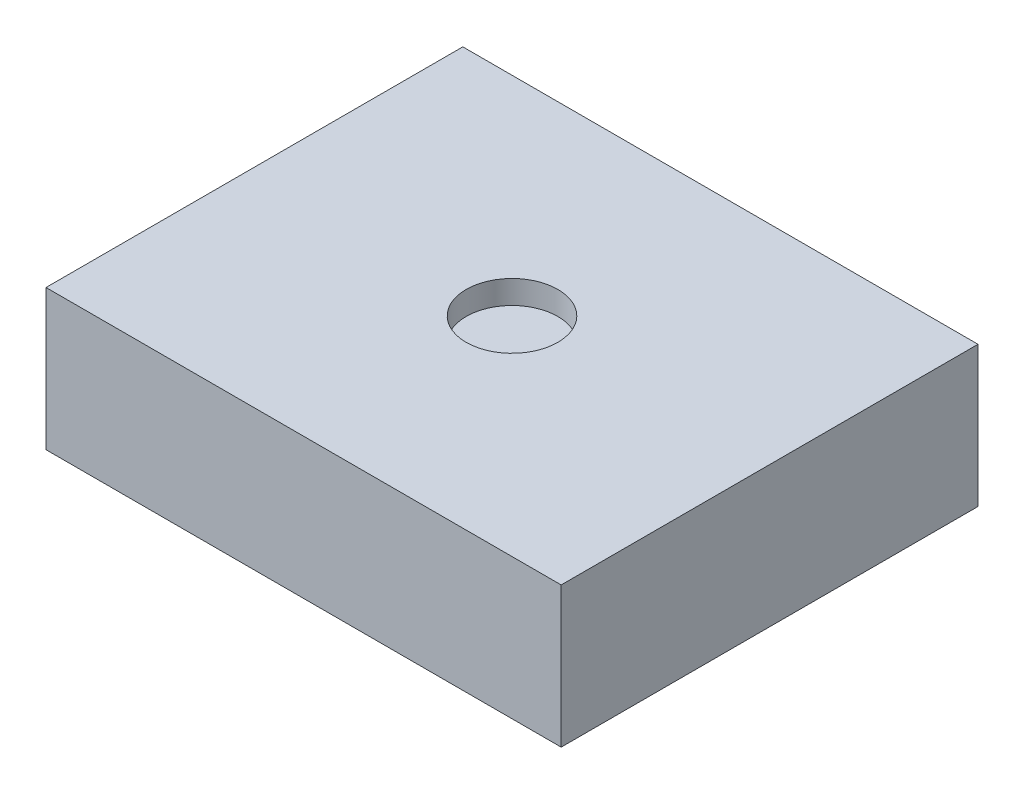
ISO-10303-21;
HEADER;
FILE_DESCRIPTION(('STEP AP214'),'2;1');
FILE_NAME('part.step','',(''),(''),'','','');
FILE_SCHEMA(('AUTOMOTIVE_DESIGN { 1 0 10303 214 1 1 1 1 }'));
ENDSEC;
DATA;
#1=APPLICATION_CONTEXT('core data for automotive mechanical design processes');
#2=APPLICATION_PROTOCOL_DEFINITION('international standard','automotive_design',2000,#1);
#3=PRODUCT_CONTEXT('',#1,'mechanical');
#4=PRODUCT('Part','Part','',(#3));
#5=PRODUCT_RELATED_PRODUCT_CATEGORY('part','',(#4));
#6=PRODUCT_DEFINITION_FORMATION('','',#4);
#7=PRODUCT_DEFINITION_CONTEXT('part definition',#1,'design');
#8=PRODUCT_DEFINITION('design','',#6,#7);
#9=PRODUCT_DEFINITION_SHAPE('','',#8);
#10=(LENGTH_UNIT() NAMED_UNIT(*) SI_UNIT(.MILLI.,.METRE.));
#11=(NAMED_UNIT(*) PLANE_ANGLE_UNIT() SI_UNIT($,.RADIAN.));
#12=(NAMED_UNIT(*) SI_UNIT($,.STERADIAN.) SOLID_ANGLE_UNIT());
#13=UNCERTAINTY_MEASURE_WITH_UNIT(LENGTH_MEASURE(1.E-05),#10,'distance_accuracy_value','');
#14=(GEOMETRIC_REPRESENTATION_CONTEXT(3) GLOBAL_UNCERTAINTY_ASSIGNED_CONTEXT((#13)) GLOBAL_UNIT_ASSIGNED_CONTEXT((#10,
#11,#12)) REPRESENTATION_CONTEXT('',''));
#15=CARTESIAN_POINT('',(0.,0.,0.));
#16=DIRECTION('',(0.,0.,1.));
#17=DIRECTION('',(1.,0.,0.));
#18=AXIS2_PLACEMENT_3D('',#15,#16,#17);
#19=CARTESIAN_POINT('',(13.97,7.62,11.303));
#20=DIRECTION('',(-1.,0.,0.));
#21=DIRECTION('',(0.,0.,1.));
#22=AXIS2_PLACEMENT_3D('',#19,#20,#21);
#23=PLANE('',#22);
#24=DIRECTION('',(0.,0.,-1.));
#25=VECTOR('',#24,1.);
#26=CARTESIAN_POINT('',(13.97,0.,11.303));
#27=LINE('',#26,#25);
#28=CARTESIAN_POINT('',(13.97,0.,11.303));
#29=VERTEX_POINT('',#28);
#30=CARTESIAN_POINT('',(13.97,0.,-11.303));
#31=VERTEX_POINT('',#30);
#32=EDGE_CURVE('E96',#29,#31,#27,.T.);
#33=ORIENTED_EDGE('',*,*,#32,.T.);
#34=DIRECTION('',(0.,-1.,0.));
#35=VECTOR('',#34,1.);
#36=CARTESIAN_POINT('',(13.97,7.62,-11.303));
#37=LINE('',#36,#35);
#38=CARTESIAN_POINT('',(13.97,7.62,-11.303));
#39=VERTEX_POINT('',#38);
#40=EDGE_CURVE('E11',#39,#31,#37,.T.);
#41=ORIENTED_EDGE('',*,*,#40,.F.);
#42=DIRECTION('',(0.,0.,-1.));
#43=VECTOR('',#42,1.);
#44=CARTESIAN_POINT('',(13.97,7.62,11.303));
#45=LINE('',#44,#43);
#46=CARTESIAN_POINT('',(13.97,7.62,11.303));
#47=VERTEX_POINT('',#46);
#48=EDGE_CURVE('E84',#47,#39,#45,.T.);
#49=ORIENTED_EDGE('',*,*,#48,.F.);
#50=DIRECTION('',(0.,-1.,0.));
#51=VECTOR('',#50,1.);
#52=CARTESIAN_POINT('',(13.97,7.62,11.303));
#53=LINE('',#52,#51);
#54=EDGE_CURVE('E92',#47,#29,#53,.T.);
#55=ORIENTED_EDGE('',*,*,#54,.T.);
#56=EDGE_LOOP('',(#33,#41,#49,#55));
#57=FACE_BOUND('',#56,.T.);
#58=ADVANCED_FACE('F33',(#57),#23,.F.);
#59=CARTESIAN_POINT('',(-13.97,7.62,-11.303));
#60=DIRECTION('',(0.,0.,1.));
#61=DIRECTION('',(1.,0.,0.));
#62=AXIS2_PLACEMENT_3D('',#59,#60,#61);
#63=PLANE('',#62);
#64=DIRECTION('',(-1.,0.,0.));
#65=VECTOR('',#64,1.);
#66=CARTESIAN_POINT('',(-13.97,0.,-11.303));
#67=LINE('',#66,#65);
#68=CARTESIAN_POINT('',(-13.97,0.,-11.303));
#69=VERTEX_POINT('',#68);
#70=EDGE_CURVE('E88',#31,#69,#67,.T.);
#71=ORIENTED_EDGE('',*,*,#70,.T.);
#72=DIRECTION('',(0.,-1.,0.));
#73=VECTOR('',#72,1.);
#74=CARTESIAN_POINT('',(-13.97,7.62,-11.303));
#75=LINE('',#74,#73);
#76=CARTESIAN_POINT('',(-13.97,7.62,-11.303));
#77=VERTEX_POINT('',#76);
#78=EDGE_CURVE('E41',#77,#69,#75,.T.);
#79=ORIENTED_EDGE('',*,*,#78,.F.);
#80=DIRECTION('',(-1.,0.,0.));
#81=VECTOR('',#80,1.);
#82=CARTESIAN_POINT('',(-13.97,7.62,-11.303));
#83=LINE('',#82,#81);
#84=EDGE_CURVE('E79',#39,#77,#83,.T.);
#85=ORIENTED_EDGE('',*,*,#84,.F.);
#86=ORIENTED_EDGE('',*,*,#40,.T.);
#87=EDGE_LOOP('',(#71,#79,#85,#86));
#88=FACE_BOUND('',#87,.T.);
#89=ADVANCED_FACE('F87',(#88),#63,.F.);
#90=CARTESIAN_POINT('',(-13.97,7.62,11.303));
#91=DIRECTION('',(1.,0.,0.));
#92=DIRECTION('',(0.,0.,-1.));
#93=AXIS2_PLACEMENT_3D('',#90,#91,#92);
#94=PLANE('',#93);
#95=DIRECTION('',(0.,0.,1.));
#96=VECTOR('',#95,1.);
#97=CARTESIAN_POINT('',(-13.97,0.,11.303));
#98=LINE('',#97,#96);
#99=CARTESIAN_POINT('',(-13.97,0.,11.303));
#100=VERTEX_POINT('',#99);
#101=EDGE_CURVE('E66',#69,#100,#98,.T.);
#102=ORIENTED_EDGE('',*,*,#101,.T.);
#103=DIRECTION('',(0.,-1.,0.));
#104=VECTOR('',#103,1.);
#105=CARTESIAN_POINT('',(-13.97,7.62,11.303));
#106=LINE('',#105,#104);
#107=CARTESIAN_POINT('',(-13.97,7.62,11.303));
#108=VERTEX_POINT('',#107);
#109=EDGE_CURVE('E89',#108,#100,#106,.T.);
#110=ORIENTED_EDGE('',*,*,#109,.F.);
#111=DIRECTION('',(0.,0.,1.));
#112=VECTOR('',#111,1.);
#113=CARTESIAN_POINT('',(-13.97,7.62,11.303));
#114=LINE('',#113,#112);
#115=EDGE_CURVE('E82',#77,#108,#114,.T.);
#116=ORIENTED_EDGE('',*,*,#115,.F.);
#117=ORIENTED_EDGE('',*,*,#78,.T.);
#118=EDGE_LOOP('',(#102,#110,#116,#117));
#119=FACE_BOUND('',#118,.T.);
#120=ADVANCED_FACE('F90',(#119),#94,.F.);
#121=CARTESIAN_POINT('',(-13.97,7.62,11.303));
#122=DIRECTION('',(0.,0.,-1.));
#123=DIRECTION('',(-1.,0.,0.));
#124=AXIS2_PLACEMENT_3D('',#121,#122,#123);
#125=PLANE('',#124);
#126=DIRECTION('',(1.,0.,0.));
#127=VECTOR('',#126,1.);
#128=CARTESIAN_POINT('',(-13.97,0.,11.303));
#129=LINE('',#128,#127);
#130=EDGE_CURVE('E72',#100,#29,#129,.T.);
#131=ORIENTED_EDGE('',*,*,#130,.T.);
#132=ORIENTED_EDGE('',*,*,#54,.F.);
#133=DIRECTION('',(1.,0.,0.));
#134=VECTOR('',#133,1.);
#135=CARTESIAN_POINT('',(-13.97,7.62,11.303));
#136=LINE('',#135,#134);
#137=EDGE_CURVE('E49',#108,#47,#136,.T.);
#138=ORIENTED_EDGE('',*,*,#137,.F.);
#139=ORIENTED_EDGE('',*,*,#109,.T.);
#140=EDGE_LOOP('',(#131,#132,#138,#139));
#141=FACE_BOUND('',#140,.T.);
#142=ADVANCED_FACE('F104',(#141),#125,.F.);
#143=CARTESIAN_POINT('',(0.,7.62,0.));
#144=DIRECTION('',(0.,-1.,0.));
#145=DIRECTION('',(0.,0.,-1.));
#146=AXIS2_PLACEMENT_3D('',#143,#144,#145);
#147=PLANE('',#146);
#148=CARTESIAN_POINT('',(0.,7.62,0.));
#149=DIRECTION('',(0.,1.,0.));
#150=DIRECTION('',(0.,0.,1.));
#151=AXIS2_PLACEMENT_3D('',#148,#149,#150);
#152=CIRCLE('',#151,2.48630029454097);
#153=CARTESIAN_POINT('',(0.,7.62,2.48630029454097));
#154=VERTEX_POINT('',#153);
#155=EDGE_CURVE('E110',#154,#154,#152,.T.);
#156=ORIENTED_EDGE('',*,*,#155,.F.);
#157=EDGE_LOOP('',(#156));
#158=FACE_BOUND('',#157,.T.);
#159=ORIENTED_EDGE('',*,*,#48,.T.);
#160=ORIENTED_EDGE('',*,*,#84,.T.);
#161=ORIENTED_EDGE('',*,*,#115,.T.);
#162=ORIENTED_EDGE('',*,*,#137,.T.);
#163=EDGE_LOOP('',(#159,#160,#161,#162));
#164=FACE_BOUND('',#163,.T.);
#165=ADVANCED_FACE('F80',(#158,#164),#147,.F.);
#166=CARTESIAN_POINT('',(0.,0.,0.));
#167=DIRECTION('',(0.,-1.,0.));
#168=DIRECTION('',(0.,0.,-1.));
#169=AXIS2_PLACEMENT_3D('',#166,#167,#168);
#170=PLANE('',#169);
#171=ORIENTED_EDGE('',*,*,#32,.F.);
#172=ORIENTED_EDGE('',*,*,#130,.F.);
#173=ORIENTED_EDGE('',*,*,#101,.F.);
#174=ORIENTED_EDGE('',*,*,#70,.F.);
#175=EDGE_LOOP('',(#171,#172,#173,#174));
#176=FACE_BOUND('',#175,.T.);
#177=ADVANCED_FACE('F107',(#176),#170,.T.);
#178=CARTESIAN_POINT('',(0.,6.35,0.));
#179=DIRECTION('',(0.,1.,0.));
#180=DIRECTION('',(0.,0.,1.));
#181=AXIS2_PLACEMENT_3D('',#178,#179,#180);
#182=CYLINDRICAL_SURFACE('',#181,2.48630029454097);
#183=CARTESIAN_POINT('',(0.,6.35,0.));
#184=DIRECTION('',(0.,1.,0.));
#185=DIRECTION('',(0.,0.,1.));
#186=AXIS2_PLACEMENT_3D('',#183,#184,#185);
#187=CIRCLE('',#186,2.48630029454097);
#188=CARTESIAN_POINT('',(0.,6.35,2.48630029454097));
#189=VERTEX_POINT('',#188);
#190=EDGE_CURVE('E99',#189,#189,#187,.T.);
#191=ORIENTED_EDGE('',*,*,#190,.F.);
#192=EDGE_LOOP('',(#191));
#193=FACE_BOUND('',#192,.T.);
#194=ORIENTED_EDGE('',*,*,#155,.T.);
#195=EDGE_LOOP('',(#194));
#196=FACE_BOUND('',#195,.T.);
#197=ADVANCED_FACE('F118',(#193,#196),#182,.F.);
#198=CARTESIAN_POINT('',(0.,6.35,0.));
#199=DIRECTION('',(0.,1.,0.));
#200=DIRECTION('',(0.,0.,1.));
#201=AXIS2_PLACEMENT_3D('',#198,#199,#200);
#202=PLANE('',#201);
#203=ORIENTED_EDGE('',*,*,#190,.T.);
#204=EDGE_LOOP('',(#203));
#205=FACE_BOUND('',#204,.T.);
#206=ADVANCED_FACE('F116',(#205),#202,.T.);
#207=CLOSED_SHELL('',(#58,#89,#120,#142,#165,#177,#197,#206));
#208=MANIFOLD_SOLID_BREP('B2',#207);
#209=ADVANCED_BREP_SHAPE_REPRESENTATION('',(#18,#208),#14);
#210=SHAPE_DEFINITION_REPRESENTATION(#9,#209);
ENDSEC;
END-ISO-10303-21;
